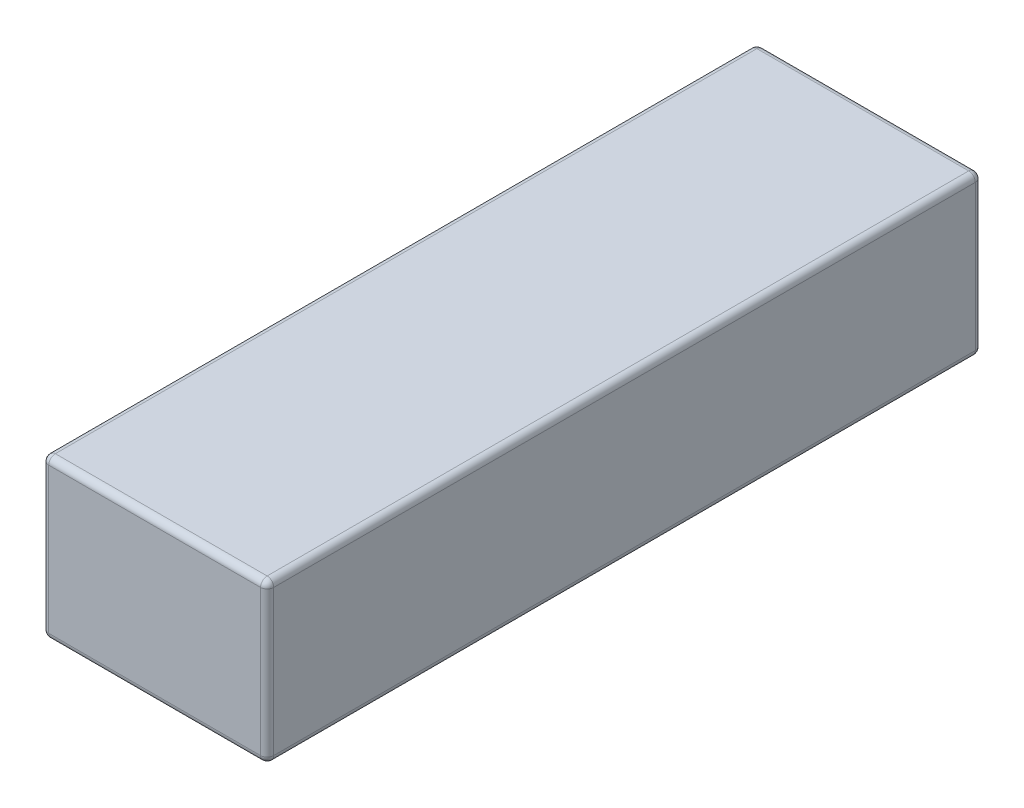
ISO-10303-21;
HEADER;
FILE_DESCRIPTION(('STEP AP214'),'2;1');
FILE_NAME('part.step','',(''),(''),'','','');
FILE_SCHEMA(('AUTOMOTIVE_DESIGN { 1 0 10303 214 1 1 1 1 }'));
ENDSEC;
DATA;
#1=APPLICATION_CONTEXT('core data for automotive mechanical design processes');
#2=APPLICATION_PROTOCOL_DEFINITION('international standard','automotive_design',2000,#1);
#3=PRODUCT_CONTEXT('',#1,'mechanical');
#4=PRODUCT('Part','Part','',(#3));
#5=PRODUCT_RELATED_PRODUCT_CATEGORY('part','',(#4));
#6=PRODUCT_DEFINITION_FORMATION('','',#4);
#7=PRODUCT_DEFINITION_CONTEXT('part definition',#1,'design');
#8=PRODUCT_DEFINITION('design','',#6,#7);
#9=PRODUCT_DEFINITION_SHAPE('','',#8);
#10=(LENGTH_UNIT() NAMED_UNIT(*) SI_UNIT(.MILLI.,.METRE.));
#11=(NAMED_UNIT(*) PLANE_ANGLE_UNIT() SI_UNIT($,.RADIAN.));
#12=(NAMED_UNIT(*) SI_UNIT($,.STERADIAN.) SOLID_ANGLE_UNIT());
#13=UNCERTAINTY_MEASURE_WITH_UNIT(LENGTH_MEASURE(1.E-05),#10,'distance_accuracy_value','');
#14=(GEOMETRIC_REPRESENTATION_CONTEXT(3) GLOBAL_UNCERTAINTY_ASSIGNED_CONTEXT((#13)) GLOBAL_UNIT_ASSIGNED_CONTEXT((#10,
#11,#12)) REPRESENTATION_CONTEXT('',''));
#15=CARTESIAN_POINT('',(0.,0.,0.));
#16=DIRECTION('',(0.,0.,1.));
#17=DIRECTION('',(1.,0.,0.));
#18=AXIS2_PLACEMENT_3D('',#15,#16,#17);
#19=CARTESIAN_POINT('',(-17.,12.,108.));
#20=DIRECTION('',(1.,0.,0.));
#21=DIRECTION('',(0.,1.,0.));
#22=AXIS2_PLACEMENT_3D('',#19,#20,#21);
#23=PLANE('',#22);
#24=DIRECTION('',(0.,-1.,0.));
#25=VECTOR('',#24,1.);
#26=CARTESIAN_POINT('',(-17.,12.,107.));
#27=LINE('',#26,#25);
#28=CARTESIAN_POINT('',(-17.,-11.,107.));
#29=VERTEX_POINT('',#28);
#30=CARTESIAN_POINT('',(-17.,11.,107.));
#31=VERTEX_POINT('',#30);
#32=EDGE_CURVE('E183',#29,#31,#27,.F.);
#33=ORIENTED_EDGE('',*,*,#32,.T.);
#34=DIRECTION('',(0.,0.,-1.));
#35=VECTOR('',#34,1.);
#36=CARTESIAN_POINT('',(-17.,11.,108.));
#37=LINE('',#36,#35);
#38=CARTESIAN_POINT('',(-17.,11.,1.));
#39=VERTEX_POINT('',#38);
#40=EDGE_CURVE('E185',#31,#39,#37,.T.);
#41=ORIENTED_EDGE('',*,*,#40,.T.);
#42=DIRECTION('',(0.,-1.,0.));
#43=VECTOR('',#42,1.);
#44=CARTESIAN_POINT('',(-17.,12.,1.));
#45=LINE('',#44,#43);
#46=CARTESIAN_POINT('',(-17.,-11.,1.));
#47=VERTEX_POINT('',#46);
#48=EDGE_CURVE('E181',#39,#47,#45,.T.);
#49=ORIENTED_EDGE('',*,*,#48,.T.);
#50=DIRECTION('',(0.,0.,-1.));
#51=VECTOR('',#50,1.);
#52=CARTESIAN_POINT('',(-17.,-11.,108.));
#53=LINE('',#52,#51);
#54=EDGE_CURVE('E179',#47,#29,#53,.F.);
#55=ORIENTED_EDGE('',*,*,#54,.T.);
#56=EDGE_LOOP('',(#33,#41,#49,#55));
#57=FACE_BOUND('',#56,.T.);
#58=ADVANCED_FACE('F32',(#57),#23,.F.);
#59=CARTESIAN_POINT('',(-17.,-12.,108.));
#60=DIRECTION('',(0.,1.,0.));
#61=DIRECTION('',(0.,0.,1.));
#62=AXIS2_PLACEMENT_3D('',#59,#60,#61);
#63=PLANE('',#62);
#64=DIRECTION('',(1.,0.,0.));
#65=VECTOR('',#64,1.);
#66=CARTESIAN_POINT('',(-17.,-12.,107.));
#67=LINE('',#66,#65);
#68=CARTESIAN_POINT('',(16.,-12.,107.));
#69=VERTEX_POINT('',#68);
#70=CARTESIAN_POINT('',(-16.,-12.,107.));
#71=VERTEX_POINT('',#70);
#72=EDGE_CURVE('E192',#69,#71,#67,.F.);
#73=ORIENTED_EDGE('',*,*,#72,.T.);
#74=DIRECTION('',(0.,0.,-1.));
#75=VECTOR('',#74,1.);
#76=CARTESIAN_POINT('',(-16.,-12.,108.));
#77=LINE('',#76,#75);
#78=CARTESIAN_POINT('',(-16.,-12.,1.));
#79=VERTEX_POINT('',#78);
#80=EDGE_CURVE('E194',#71,#79,#77,.T.);
#81=ORIENTED_EDGE('',*,*,#80,.T.);
#82=DIRECTION('',(1.,0.,0.));
#83=VECTOR('',#82,1.);
#84=CARTESIAN_POINT('',(-17.,-12.,1.));
#85=LINE('',#84,#83);
#86=CARTESIAN_POINT('',(16.,-12.,1.));
#87=VERTEX_POINT('',#86);
#88=EDGE_CURVE('E190',#79,#87,#85,.T.);
#89=ORIENTED_EDGE('',*,*,#88,.T.);
#90=DIRECTION('',(0.,0.,-1.));
#91=VECTOR('',#90,1.);
#92=CARTESIAN_POINT('',(16.,-12.,108.));
#93=LINE('',#92,#91);
#94=EDGE_CURVE('E188',#87,#69,#93,.F.);
#95=ORIENTED_EDGE('',*,*,#94,.T.);
#96=EDGE_LOOP('',(#73,#81,#89,#95));
#97=FACE_BOUND('',#96,.T.);
#98=ADVANCED_FACE('F271',(#97),#63,.F.);
#99=CARTESIAN_POINT('',(17.,12.,108.));
#100=DIRECTION('',(-1.,0.,0.));
#101=DIRECTION('',(0.,-1.,0.));
#102=AXIS2_PLACEMENT_3D('',#99,#100,#101);
#103=PLANE('',#102);
#104=DIRECTION('',(0.,1.,0.));
#105=VECTOR('',#104,1.);
#106=CARTESIAN_POINT('',(17.,-12.,107.));
#107=LINE('',#106,#105);
#108=CARTESIAN_POINT('',(17.,11.,107.));
#109=VERTEX_POINT('',#108);
#110=CARTESIAN_POINT('',(17.,-11.,107.));
#111=VERTEX_POINT('',#110);
#112=EDGE_CURVE('E41',#109,#111,#107,.F.);
#113=ORIENTED_EDGE('',*,*,#112,.T.);
#114=DIRECTION('',(0.,0.,-1.));
#115=VECTOR('',#114,1.);
#116=CARTESIAN_POINT('',(17.,-11.,108.));
#117=LINE('',#116,#115);
#118=CARTESIAN_POINT('',(17.,-11.,1.));
#119=VERTEX_POINT('',#118);
#120=EDGE_CURVE('E11',#111,#119,#117,.T.);
#121=ORIENTED_EDGE('',*,*,#120,.T.);
#122=DIRECTION('',(0.,1.,0.));
#123=VECTOR('',#122,1.);
#124=CARTESIAN_POINT('',(17.,12.,1.));
#125=LINE('',#124,#123);
#126=CARTESIAN_POINT('',(17.,11.,1.));
#127=VERTEX_POINT('',#126);
#128=EDGE_CURVE('E197',#119,#127,#125,.T.);
#129=ORIENTED_EDGE('',*,*,#128,.T.);
#130=DIRECTION('',(0.,0.,-1.));
#131=VECTOR('',#130,1.);
#132=CARTESIAN_POINT('',(17.,11.,108.));
#133=LINE('',#132,#131);
#134=EDGE_CURVE('E52',#127,#109,#133,.F.);
#135=ORIENTED_EDGE('',*,*,#134,.T.);
#136=EDGE_LOOP('',(#113,#121,#129,#135));
#137=FACE_BOUND('',#136,.T.);
#138=ADVANCED_FACE('F284',(#137),#103,.F.);
#139=CARTESIAN_POINT('',(-17.,12.,108.));
#140=DIRECTION('',(0.,-1.,0.));
#141=DIRECTION('',(0.,0.,-1.));
#142=AXIS2_PLACEMENT_3D('',#139,#140,#141);
#143=PLANE('',#142);
#144=DIRECTION('',(-1.,0.,0.));
#145=VECTOR('',#144,1.);
#146=CARTESIAN_POINT('',(-17.,12.,1.));
#147=LINE('',#146,#145);
#148=CARTESIAN_POINT('',(16.,12.,1.));
#149=VERTEX_POINT('',#148);
#150=CARTESIAN_POINT('',(-16.,12.,1.));
#151=VERTEX_POINT('',#150);
#152=EDGE_CURVE('E131',#149,#151,#147,.T.);
#153=ORIENTED_EDGE('',*,*,#152,.T.);
#154=DIRECTION('',(0.,0.,-1.));
#155=VECTOR('',#154,1.);
#156=CARTESIAN_POINT('',(-16.,12.,108.));
#157=LINE('',#156,#155);
#158=CARTESIAN_POINT('',(-16.,12.,107.));
#159=VERTEX_POINT('',#158);
#160=EDGE_CURVE('E127',#151,#159,#157,.F.);
#161=ORIENTED_EDGE('',*,*,#160,.T.);
#162=DIRECTION('',(-1.,0.,0.));
#163=VECTOR('',#162,1.);
#164=CARTESIAN_POINT('',(17.,12.,107.));
#165=LINE('',#164,#163);
#166=CARTESIAN_POINT('',(16.,12.,107.));
#167=VERTEX_POINT('',#166);
#168=EDGE_CURVE('E119',#159,#167,#165,.F.);
#169=ORIENTED_EDGE('',*,*,#168,.T.);
#170=DIRECTION('',(0.,0.,-1.));
#171=VECTOR('',#170,1.);
#172=CARTESIAN_POINT('',(16.,12.,108.));
#173=LINE('',#172,#171);
#174=EDGE_CURVE('E124',#167,#149,#173,.T.);
#175=ORIENTED_EDGE('',*,*,#174,.T.);
#176=EDGE_LOOP('',(#153,#161,#169,#175));
#177=FACE_BOUND('',#176,.T.);
#178=ADVANCED_FACE('F122',(#177),#143,.F.);
#179=CARTESIAN_POINT('',(0.,0.,108.));
#180=DIRECTION('',(0.,0.,1.));
#181=DIRECTION('',(1.,0.,0.));
#182=AXIS2_PLACEMENT_3D('',#179,#180,#181);
#183=PLANE('',#182);
#184=DIRECTION('',(0.,1.,0.));
#185=VECTOR('',#184,1.);
#186=CARTESIAN_POINT('',(16.,12.,108.));
#187=LINE('',#186,#185);
#188=CARTESIAN_POINT('',(16.,-11.,108.));
#189=VERTEX_POINT('',#188);
#190=CARTESIAN_POINT('',(16.,11.,108.));
#191=VERTEX_POINT('',#190);
#192=EDGE_CURVE('E172',#189,#191,#187,.T.);
#193=ORIENTED_EDGE('',*,*,#192,.T.);
#194=DIRECTION('',(-1.,0.,0.));
#195=VECTOR('',#194,1.);
#196=CARTESIAN_POINT('',(-17.,11.,108.));
#197=LINE('',#196,#195);
#198=CARTESIAN_POINT('',(-16.,11.,108.));
#199=VERTEX_POINT('',#198);
#200=EDGE_CURVE('E139',#191,#199,#197,.T.);
#201=ORIENTED_EDGE('',*,*,#200,.T.);
#202=DIRECTION('',(0.,-1.,0.));
#203=VECTOR('',#202,1.);
#204=CARTESIAN_POINT('',(-16.,-12.,108.));
#205=LINE('',#204,#203);
#206=CARTESIAN_POINT('',(-16.,-11.,108.));
#207=VERTEX_POINT('',#206);
#208=EDGE_CURVE('E176',#199,#207,#205,.T.);
#209=ORIENTED_EDGE('',*,*,#208,.T.);
#210=DIRECTION('',(1.,0.,0.));
#211=VECTOR('',#210,1.);
#212=CARTESIAN_POINT('',(17.,-11.,108.));
#213=LINE('',#212,#211);
#214=EDGE_CURVE('E174',#207,#189,#213,.T.);
#215=ORIENTED_EDGE('',*,*,#214,.T.);
#216=EDGE_LOOP('',(#193,#201,#209,#215));
#217=FACE_BOUND('',#216,.T.);
#218=ADVANCED_FACE('F476',(#217),#183,.T.);
#219=CARTESIAN_POINT('',(0.,0.,0.));
#220=DIRECTION('',(0.,0.,1.));
#221=DIRECTION('',(1.,0.,0.));
#222=AXIS2_PLACEMENT_3D('',#219,#220,#221);
#223=PLANE('',#222);
#224=DIRECTION('',(0.,-1.,0.));
#225=VECTOR('',#224,1.);
#226=CARTESIAN_POINT('',(-16.,0.,0.));
#227=LINE('',#226,#225);
#228=CARTESIAN_POINT('',(-16.,-11.,0.));
#229=VERTEX_POINT('',#228);
#230=CARTESIAN_POINT('',(-16.,11.,0.));
#231=VERTEX_POINT('',#230);
#232=EDGE_CURVE('E167',#229,#231,#227,.F.);
#233=ORIENTED_EDGE('',*,*,#232,.T.);
#234=DIRECTION('',(-1.,0.,0.));
#235=VECTOR('',#234,1.);
#236=CARTESIAN_POINT('',(0.,11.,0.));
#237=LINE('',#236,#235);
#238=CARTESIAN_POINT('',(16.,11.,0.));
#239=VERTEX_POINT('',#238);
#240=EDGE_CURVE('E169',#231,#239,#237,.F.);
#241=ORIENTED_EDGE('',*,*,#240,.T.);
#242=DIRECTION('',(0.,1.,0.));
#243=VECTOR('',#242,1.);
#244=CARTESIAN_POINT('',(16.,0.,0.));
#245=LINE('',#244,#243);
#246=CARTESIAN_POINT('',(16.,-11.,0.));
#247=VERTEX_POINT('',#246);
#248=EDGE_CURVE('E163',#239,#247,#245,.F.);
#249=ORIENTED_EDGE('',*,*,#248,.T.);
#250=DIRECTION('',(1.,0.,0.));
#251=VECTOR('',#250,1.);
#252=CARTESIAN_POINT('',(0.,-11.,0.));
#253=LINE('',#252,#251);
#254=EDGE_CURVE('E165',#247,#229,#253,.F.);
#255=ORIENTED_EDGE('',*,*,#254,.T.);
#256=EDGE_LOOP('',(#233,#241,#249,#255));
#257=FACE_BOUND('',#256,.T.);
#258=ADVANCED_FACE('F469',(#257),#223,.F.);
#259=CARTESIAN_POINT('',(0.,-11.,107.));
#260=DIRECTION('',(-1.,0.,0.));
#261=DIRECTION('',(0.,0.,1.));
#262=AXIS2_PLACEMENT_3D('',#259,#260,#261);
#263=CYLINDRICAL_SURFACE('',#262,1.);
#264=CARTESIAN_POINT('',(16.,-11.,107.));
#265=DIRECTION('',(1.,0.,0.));
#266=DIRECTION('',(0.,0.,-1.));
#267=AXIS2_PLACEMENT_3D('',#264,#265,#266);
#268=CIRCLE('',#267,1.);
#269=EDGE_CURVE('E36',#189,#69,#268,.T.);
#270=ORIENTED_EDGE('',*,*,#269,.F.);
#271=ORIENTED_EDGE('',*,*,#214,.F.);
#272=CARTESIAN_POINT('',(-16.,-11.,107.));
#273=DIRECTION('',(-1.,0.,0.));
#274=DIRECTION('',(0.,0.,1.));
#275=AXIS2_PLACEMENT_3D('',#272,#273,#274);
#276=CIRCLE('',#275,1.);
#277=EDGE_CURVE('E159',#71,#207,#276,.T.);
#278=ORIENTED_EDGE('',*,*,#277,.F.);
#279=ORIENTED_EDGE('',*,*,#72,.F.);
#280=EDGE_LOOP('',(#270,#271,#278,#279));
#281=FACE_BOUND('',#280,.T.);
#282=ADVANCED_FACE('F34',(#281),#263,.T.);
#283=CARTESIAN_POINT('',(16.,-11.,107.));
#284=DIRECTION('',(0.,0.,1.));
#285=DIRECTION('',(1.,0.,0.));
#286=AXIS2_PLACEMENT_3D('',#283,#284,#285);
#287=SPHERICAL_SURFACE('',#286,1.);
#288=CARTESIAN_POINT('',(16.,-11.,107.));
#289=DIRECTION('',(0.,-1.,0.));
#290=DIRECTION('',(0.,0.,-1.));
#291=AXIS2_PLACEMENT_3D('',#288,#289,#290);
#292=CIRCLE('',#291,1.);
#293=EDGE_CURVE('E242',#189,#111,#292,.F.);
#294=ORIENTED_EDGE('',*,*,#293,.F.);
#295=ORIENTED_EDGE('',*,*,#269,.T.);
#296=CARTESIAN_POINT('',(16.,-11.,107.));
#297=DIRECTION('',(0.,0.,1.));
#298=DIRECTION('',(1.,0.,0.));
#299=AXIS2_PLACEMENT_3D('',#296,#297,#298);
#300=CIRCLE('',#299,1.);
#301=EDGE_CURVE('E244',#111,#69,#300,.F.);
#302=ORIENTED_EDGE('',*,*,#301,.F.);
#303=EDGE_LOOP('',(#294,#295,#302));
#304=FACE_BOUND('',#303,.T.);
#305=ADVANCED_FACE('F277',(#304),#287,.T.);
#306=CARTESIAN_POINT('',(-16.,-11.,107.));
#307=DIRECTION('',(0.,0.,1.));
#308=DIRECTION('',(1.,0.,0.));
#309=AXIS2_PLACEMENT_3D('',#306,#307,#308);
#310=SPHERICAL_SURFACE('',#309,1.);
#311=CARTESIAN_POINT('',(-16.,-11.,107.));
#312=DIRECTION('',(0.,0.,1.));
#313=DIRECTION('',(1.,0.,0.));
#314=AXIS2_PLACEMENT_3D('',#311,#312,#313);
#315=CIRCLE('',#314,1.);
#316=EDGE_CURVE('E236',#71,#29,#315,.F.);
#317=ORIENTED_EDGE('',*,*,#316,.F.);
#318=ORIENTED_EDGE('',*,*,#277,.T.);
#319=CARTESIAN_POINT('',(-16.,-11.,107.));
#320=DIRECTION('',(0.,-1.,0.));
#321=DIRECTION('',(0.,0.,-1.));
#322=AXIS2_PLACEMENT_3D('',#319,#320,#321);
#323=CIRCLE('',#322,1.);
#324=EDGE_CURVE('E239',#29,#207,#323,.F.);
#325=ORIENTED_EDGE('',*,*,#324,.F.);
#326=EDGE_LOOP('',(#317,#318,#325));
#327=FACE_BOUND('',#326,.T.);
#328=ADVANCED_FACE('F251',(#327),#310,.T.);
#329=CARTESIAN_POINT('',(16.,-11.,108.));
#330=DIRECTION('',(0.,0.,-1.));
#331=DIRECTION('',(-1.,0.,0.));
#332=AXIS2_PLACEMENT_3D('',#329,#330,#331);
#333=CYLINDRICAL_SURFACE('',#332,1.);
#334=ORIENTED_EDGE('',*,*,#301,.T.);
#335=ORIENTED_EDGE('',*,*,#94,.F.);
#336=CARTESIAN_POINT('',(16.,-11.,1.));
#337=DIRECTION('',(0.,0.,-1.));
#338=DIRECTION('',(-1.,0.,0.));
#339=AXIS2_PLACEMENT_3D('',#336,#337,#338);
#340=CIRCLE('',#339,1.);
#341=EDGE_CURVE('E230',#119,#87,#340,.T.);
#342=ORIENTED_EDGE('',*,*,#341,.F.);
#343=ORIENTED_EDGE('',*,*,#120,.F.);
#344=EDGE_LOOP('',(#334,#335,#342,#343));
#345=FACE_BOUND('',#344,.T.);
#346=ADVANCED_FACE('F281',(#345),#333,.T.);
#347=CARTESIAN_POINT('',(16.,0.,107.));
#348=DIRECTION('',(0.,-1.,0.));
#349=DIRECTION('',(1.,0.,0.));
#350=AXIS2_PLACEMENT_3D('',#347,#348,#349);
#351=CYLINDRICAL_SURFACE('',#350,1.);
#352=ORIENTED_EDGE('',*,*,#293,.T.);
#353=ORIENTED_EDGE('',*,*,#112,.F.);
#354=CARTESIAN_POINT('',(16.,11.,107.));
#355=DIRECTION('',(0.,1.,0.));
#356=DIRECTION('',(0.,0.,1.));
#357=AXIS2_PLACEMENT_3D('',#354,#355,#356);
#358=CIRCLE('',#357,1.);
#359=EDGE_CURVE('E143',#191,#109,#358,.T.);
#360=ORIENTED_EDGE('',*,*,#359,.F.);
#361=ORIENTED_EDGE('',*,*,#192,.F.);
#362=EDGE_LOOP('',(#352,#353,#360,#361));
#363=FACE_BOUND('',#362,.T.);
#364=ADVANCED_FACE('F433',(#363),#351,.T.);
#365=CARTESIAN_POINT('',(0.,11.,107.));
#366=DIRECTION('',(1.,0.,0.));
#367=DIRECTION('',(0.,0.,-1.));
#368=AXIS2_PLACEMENT_3D('',#365,#366,#367);
#369=CYLINDRICAL_SURFACE('',#368,1.);
#370=CARTESIAN_POINT('',(-16.,11.,107.));
#371=DIRECTION('',(-1.,0.,0.));
#372=DIRECTION('',(0.,0.,1.));
#373=AXIS2_PLACEMENT_3D('',#370,#371,#372);
#374=CIRCLE('',#373,1.);
#375=EDGE_CURVE('E144',#199,#159,#374,.T.);
#376=ORIENTED_EDGE('',*,*,#375,.F.);
#377=ORIENTED_EDGE('',*,*,#200,.F.);
#378=CARTESIAN_POINT('',(16.,11.,107.));
#379=DIRECTION('',(1.,0.,0.));
#380=DIRECTION('',(0.,0.,-1.));
#381=AXIS2_PLACEMENT_3D('',#378,#379,#380);
#382=CIRCLE('',#381,1.);
#383=EDGE_CURVE('E135',#167,#191,#382,.T.);
#384=ORIENTED_EDGE('',*,*,#383,.F.);
#385=ORIENTED_EDGE('',*,*,#168,.F.);
#386=EDGE_LOOP('',(#376,#377,#384,#385));
#387=FACE_BOUND('',#386,.T.);
#388=ADVANCED_FACE('F137',(#387),#369,.T.);
#389=CARTESIAN_POINT('',(-16.,0.,107.));
#390=DIRECTION('',(0.,1.,0.));
#391=DIRECTION('',(-1.,0.,0.));
#392=AXIS2_PLACEMENT_3D('',#389,#390,#391);
#393=CYLINDRICAL_SURFACE('',#392,1.);
#394=ORIENTED_EDGE('',*,*,#324,.T.);
#395=ORIENTED_EDGE('',*,*,#208,.F.);
#396=CARTESIAN_POINT('',(-16.,11.,107.));
#397=DIRECTION('',(0.,1.,0.));
#398=DIRECTION('',(0.,0.,1.));
#399=AXIS2_PLACEMENT_3D('',#396,#397,#398);
#400=CIRCLE('',#399,1.);
#401=EDGE_CURVE('E226',#31,#199,#400,.T.);
#402=ORIENTED_EDGE('',*,*,#401,.F.);
#403=ORIENTED_EDGE('',*,*,#32,.F.);
#404=EDGE_LOOP('',(#394,#395,#402,#403));
#405=FACE_BOUND('',#404,.T.);
#406=ADVANCED_FACE('F259',(#405),#393,.T.);
#407=CARTESIAN_POINT('',(-16.,-11.,108.));
#408=DIRECTION('',(0.,0.,-1.));
#409=DIRECTION('',(-1.,0.,0.));
#410=AXIS2_PLACEMENT_3D('',#407,#408,#409);
#411=CYLINDRICAL_SURFACE('',#410,1.);
#412=ORIENTED_EDGE('',*,*,#316,.T.);
#413=ORIENTED_EDGE('',*,*,#54,.F.);
#414=CARTESIAN_POINT('',(-16.,-11.,1.));
#415=DIRECTION('',(0.,0.,-1.));
#416=DIRECTION('',(-1.,0.,0.));
#417=AXIS2_PLACEMENT_3D('',#414,#415,#416);
#418=CIRCLE('',#417,1.);
#419=EDGE_CURVE('E223',#79,#47,#418,.T.);
#420=ORIENTED_EDGE('',*,*,#419,.F.);
#421=ORIENTED_EDGE('',*,*,#80,.F.);
#422=EDGE_LOOP('',(#412,#413,#420,#421));
#423=FACE_BOUND('',#422,.T.);
#424=ADVANCED_FACE('F268',(#423),#411,.T.);
#425=CARTESIAN_POINT('',(-17.,-11.,1.));
#426=DIRECTION('',(1.,0.,0.));
#427=DIRECTION('',(0.,0.,-1.));
#428=AXIS2_PLACEMENT_3D('',#425,#426,#427);
#429=CYLINDRICAL_SURFACE('',#428,1.);
#430=CARTESIAN_POINT('',(16.,-11.,1.));
#431=DIRECTION('',(1.,0.,0.));
#432=DIRECTION('',(0.,0.,-1.));
#433=AXIS2_PLACEMENT_3D('',#430,#431,#432);
#434=CIRCLE('',#433,1.);
#435=EDGE_CURVE('E233',#87,#247,#434,.T.);
#436=ORIENTED_EDGE('',*,*,#435,.F.);
#437=ORIENTED_EDGE('',*,*,#88,.F.);
#438=CARTESIAN_POINT('',(-16.,-11.,1.));
#439=DIRECTION('',(-1.,0.,0.));
#440=DIRECTION('',(0.,0.,1.));
#441=AXIS2_PLACEMENT_3D('',#438,#439,#440);
#442=CIRCLE('',#441,1.);
#443=EDGE_CURVE('E221',#229,#79,#442,.T.);
#444=ORIENTED_EDGE('',*,*,#443,.F.);
#445=ORIENTED_EDGE('',*,*,#254,.F.);
#446=EDGE_LOOP('',(#436,#437,#444,#445));
#447=FACE_BOUND('',#446,.T.);
#448=ADVANCED_FACE('F402',(#447),#429,.T.);
#449=CARTESIAN_POINT('',(16.,-11.,1.));
#450=DIRECTION('',(0.,0.,1.));
#451=DIRECTION('',(1.,0.,0.));
#452=AXIS2_PLACEMENT_3D('',#449,#450,#451);
#453=SPHERICAL_SURFACE('',#452,1.);
#454=ORIENTED_EDGE('',*,*,#341,.T.);
#455=ORIENTED_EDGE('',*,*,#435,.T.);
#456=CARTESIAN_POINT('',(16.,-11.,1.));
#457=DIRECTION('',(0.,-1.,0.));
#458=DIRECTION('',(1.,0.,0.));
#459=AXIS2_PLACEMENT_3D('',#456,#457,#458);
#460=CIRCLE('',#459,1.);
#461=EDGE_CURVE('E150',#119,#247,#460,.F.);
#462=ORIENTED_EDGE('',*,*,#461,.F.);
#463=EDGE_LOOP('',(#454,#455,#462));
#464=FACE_BOUND('',#463,.T.);
#465=ADVANCED_FACE('F314',(#464),#453,.T.);
#466=CARTESIAN_POINT('',(16.,11.,107.));
#467=DIRECTION('',(0.,0.,1.));
#468=DIRECTION('',(1.,0.,0.));
#469=AXIS2_PLACEMENT_3D('',#466,#467,#468);
#470=SPHERICAL_SURFACE('',#469,1.);
#471=ORIENTED_EDGE('',*,*,#383,.T.);
#472=ORIENTED_EDGE('',*,*,#359,.T.);
#473=CARTESIAN_POINT('',(16.,11.,107.));
#474=DIRECTION('',(0.,0.,1.));
#475=DIRECTION('',(1.,0.,0.));
#476=AXIS2_PLACEMENT_3D('',#473,#474,#475);
#477=CIRCLE('',#476,1.);
#478=EDGE_CURVE('E147',#167,#109,#477,.F.);
#479=ORIENTED_EDGE('',*,*,#478,.F.);
#480=EDGE_LOOP('',(#471,#472,#479));
#481=FACE_BOUND('',#480,.T.);
#482=ADVANCED_FACE('F148',(#481),#470,.T.);
#483=CARTESIAN_POINT('',(-16.,11.,107.));
#484=DIRECTION('',(0.,0.,1.));
#485=DIRECTION('',(1.,0.,0.));
#486=AXIS2_PLACEMENT_3D('',#483,#484,#485);
#487=SPHERICAL_SURFACE('',#486,1.);
#488=ORIENTED_EDGE('',*,*,#401,.T.);
#489=ORIENTED_EDGE('',*,*,#375,.T.);
#490=CARTESIAN_POINT('',(-16.,11.,107.));
#491=DIRECTION('',(0.,0.,1.));
#492=DIRECTION('',(1.,0.,0.));
#493=AXIS2_PLACEMENT_3D('',#490,#491,#492);
#494=CIRCLE('',#493,1.);
#495=EDGE_CURVE('E151',#31,#159,#494,.F.);
#496=ORIENTED_EDGE('',*,*,#495,.F.);
#497=EDGE_LOOP('',(#488,#489,#496));
#498=FACE_BOUND('',#497,.T.);
#499=ADVANCED_FACE('F304',(#498),#487,.T.);
#500=CARTESIAN_POINT('',(-16.,-11.,1.));
#501=DIRECTION('',(0.,0.,1.));
#502=DIRECTION('',(1.,0.,0.));
#503=AXIS2_PLACEMENT_3D('',#500,#501,#502);
#504=SPHERICAL_SURFACE('',#503,1.);
#505=ORIENTED_EDGE('',*,*,#443,.T.);
#506=ORIENTED_EDGE('',*,*,#419,.T.);
#507=CARTESIAN_POINT('',(-16.,-11.,1.));
#508=DIRECTION('',(0.,-1.,0.));
#509=DIRECTION('',(0.,0.,-1.));
#510=AXIS2_PLACEMENT_3D('',#507,#508,#509);
#511=CIRCLE('',#510,1.);
#512=EDGE_CURVE('E214',#229,#47,#511,.F.);
#513=ORIENTED_EDGE('',*,*,#512,.F.);
#514=EDGE_LOOP('',(#505,#506,#513));
#515=FACE_BOUND('',#514,.T.);
#516=ADVANCED_FACE('F306',(#515),#504,.T.);
#517=CARTESIAN_POINT('',(16.,12.,1.));
#518=DIRECTION('',(0.,1.,0.));
#519=DIRECTION('',(-1.,0.,0.));
#520=AXIS2_PLACEMENT_3D('',#517,#518,#519);
#521=CYLINDRICAL_SURFACE('',#520,1.);
#522=ORIENTED_EDGE('',*,*,#461,.T.);
#523=ORIENTED_EDGE('',*,*,#248,.F.);
#524=CARTESIAN_POINT('',(16.,11.,1.));
#525=DIRECTION('',(0.,1.,0.));
#526=DIRECTION('',(0.,0.,1.));
#527=AXIS2_PLACEMENT_3D('',#524,#525,#526);
#528=CIRCLE('',#527,1.);
#529=EDGE_CURVE('E211',#127,#239,#528,.T.);
#530=ORIENTED_EDGE('',*,*,#529,.F.);
#531=ORIENTED_EDGE('',*,*,#128,.F.);
#532=EDGE_LOOP('',(#522,#523,#530,#531));
#533=FACE_BOUND('',#532,.T.);
#534=ADVANCED_FACE('F289',(#533),#521,.T.);
#535=CARTESIAN_POINT('',(16.,11.,108.));
#536=DIRECTION('',(0.,0.,-1.));
#537=DIRECTION('',(-1.,0.,0.));
#538=AXIS2_PLACEMENT_3D('',#535,#536,#537);
#539=CYLINDRICAL_SURFACE('',#538,1.);
#540=ORIENTED_EDGE('',*,*,#478,.T.);
#541=ORIENTED_EDGE('',*,*,#134,.F.);
#542=CARTESIAN_POINT('',(16.,11.,1.));
#543=DIRECTION('',(0.,0.,-1.));
#544=DIRECTION('',(-1.,0.,0.));
#545=AXIS2_PLACEMENT_3D('',#542,#543,#544);
#546=CIRCLE('',#545,1.);
#547=EDGE_CURVE('E155',#149,#127,#546,.T.);
#548=ORIENTED_EDGE('',*,*,#547,.F.);
#549=ORIENTED_EDGE('',*,*,#174,.F.);
#550=EDGE_LOOP('',(#540,#541,#548,#549));
#551=FACE_BOUND('',#550,.T.);
#552=ADVANCED_FACE('F153',(#551),#539,.T.);
#553=CARTESIAN_POINT('',(-16.,11.,108.));
#554=DIRECTION('',(0.,0.,-1.));
#555=DIRECTION('',(-1.,0.,0.));
#556=AXIS2_PLACEMENT_3D('',#553,#554,#555);
#557=CYLINDRICAL_SURFACE('',#556,1.);
#558=ORIENTED_EDGE('',*,*,#495,.T.);
#559=ORIENTED_EDGE('',*,*,#160,.F.);
#560=CARTESIAN_POINT('',(-16.,11.,1.));
#561=DIRECTION('',(0.,0.,-1.));
#562=DIRECTION('',(-1.,0.,0.));
#563=AXIS2_PLACEMENT_3D('',#560,#561,#562);
#564=CIRCLE('',#563,1.);
#565=EDGE_CURVE('E207',#39,#151,#564,.T.);
#566=ORIENTED_EDGE('',*,*,#565,.F.);
#567=ORIENTED_EDGE('',*,*,#40,.F.);
#568=EDGE_LOOP('',(#558,#559,#566,#567));
#569=FACE_BOUND('',#568,.T.);
#570=ADVANCED_FACE('F302',(#569),#557,.T.);
#571=CARTESIAN_POINT('',(-16.,12.,1.));
#572=DIRECTION('',(0.,-1.,0.));
#573=DIRECTION('',(1.,0.,0.));
#574=AXIS2_PLACEMENT_3D('',#571,#572,#573);
#575=CYLINDRICAL_SURFACE('',#574,1.);
#576=ORIENTED_EDGE('',*,*,#512,.T.);
#577=ORIENTED_EDGE('',*,*,#48,.F.);
#578=CARTESIAN_POINT('',(-16.,11.,1.));
#579=DIRECTION('',(0.,1.,0.));
#580=DIRECTION('',(0.,0.,1.));
#581=AXIS2_PLACEMENT_3D('',#578,#579,#580);
#582=CIRCLE('',#581,1.);
#583=EDGE_CURVE('E205',#231,#39,#582,.T.);
#584=ORIENTED_EDGE('',*,*,#583,.F.);
#585=ORIENTED_EDGE('',*,*,#232,.F.);
#586=EDGE_LOOP('',(#576,#577,#584,#585));
#587=FACE_BOUND('',#586,.T.);
#588=ADVANCED_FACE('F330',(#587),#575,.T.);
#589=CARTESIAN_POINT('',(16.,11.,1.));
#590=DIRECTION('',(0.,0.,1.));
#591=DIRECTION('',(1.,0.,0.));
#592=AXIS2_PLACEMENT_3D('',#589,#590,#591);
#593=SPHERICAL_SURFACE('',#592,1.);
#594=ORIENTED_EDGE('',*,*,#547,.T.);
#595=ORIENTED_EDGE('',*,*,#529,.T.);
#596=CARTESIAN_POINT('',(16.,11.,1.));
#597=DIRECTION('',(1.,0.,0.));
#598=DIRECTION('',(0.,0.,-1.));
#599=AXIS2_PLACEMENT_3D('',#596,#597,#598);
#600=CIRCLE('',#599,1.);
#601=EDGE_CURVE('E203',#149,#239,#600,.F.);
#602=ORIENTED_EDGE('',*,*,#601,.F.);
#603=EDGE_LOOP('',(#594,#595,#602));
#604=FACE_BOUND('',#603,.T.);
#605=ADVANCED_FACE('F291',(#604),#593,.T.);
#606=CARTESIAN_POINT('',(-16.,11.,1.));
#607=DIRECTION('',(0.,0.,1.));
#608=DIRECTION('',(1.,0.,0.));
#609=AXIS2_PLACEMENT_3D('',#606,#607,#608);
#610=SPHERICAL_SURFACE('',#609,1.);
#611=ORIENTED_EDGE('',*,*,#583,.T.);
#612=ORIENTED_EDGE('',*,*,#565,.T.);
#613=CARTESIAN_POINT('',(-16.,11.,1.));
#614=DIRECTION('',(-1.,0.,0.));
#615=DIRECTION('',(0.,0.,1.));
#616=AXIS2_PLACEMENT_3D('',#613,#614,#615);
#617=CIRCLE('',#616,1.);
#618=EDGE_CURVE('E201',#231,#151,#617,.F.);
#619=ORIENTED_EDGE('',*,*,#618,.F.);
#620=EDGE_LOOP('',(#611,#612,#619));
#621=FACE_BOUND('',#620,.T.);
#622=ADVANCED_FACE('F299',(#621),#610,.T.);
#623=CARTESIAN_POINT('',(-17.,11.,1.));
#624=DIRECTION('',(-1.,0.,0.));
#625=DIRECTION('',(0.,0.,1.));
#626=AXIS2_PLACEMENT_3D('',#623,#624,#625);
#627=CYLINDRICAL_SURFACE('',#626,1.);
#628=ORIENTED_EDGE('',*,*,#601,.T.);
#629=ORIENTED_EDGE('',*,*,#240,.F.);
#630=ORIENTED_EDGE('',*,*,#618,.T.);
#631=ORIENTED_EDGE('',*,*,#152,.F.);
#632=EDGE_LOOP('',(#628,#629,#630,#631));
#633=FACE_BOUND('',#632,.T.);
#634=ADVANCED_FACE('F295',(#633),#627,.T.);
#635=CLOSED_SHELL('',(#58,#98,#138,#178,#218,#258,#282,#305,#328,#346,#364,#388,#406,#424,#448,
#465,#482,#499,#516,#534,#552,#570,#588,#605,#622,#634));
#636=MANIFOLD_SOLID_BREP('B2',#635);
#637=ADVANCED_BREP_SHAPE_REPRESENTATION('',(#18,#636),#14);
#638=SHAPE_DEFINITION_REPRESENTATION(#9,#637);
ENDSEC;
END-ISO-10303-21;
